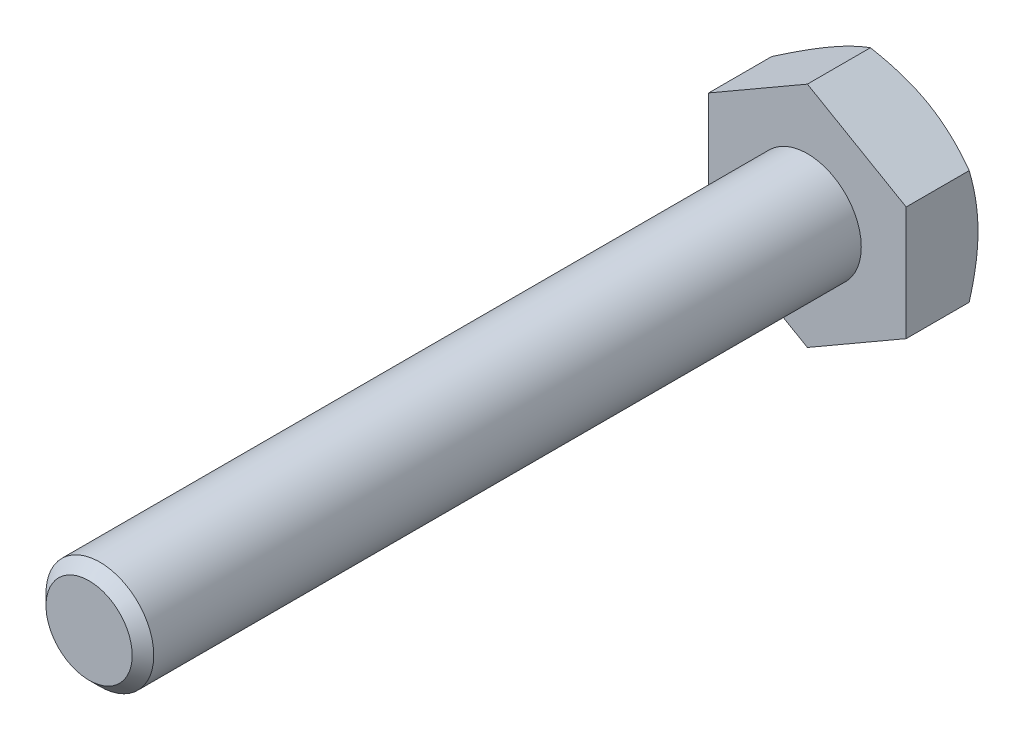
ISO-10303-21;
HEADER;
FILE_DESCRIPTION(('STEP AP214'),'2;1');
FILE_NAME('part.step','',(''),(''),'','','');
FILE_SCHEMA(('AUTOMOTIVE_DESIGN { 1 0 10303 214 1 1 1 1 }'));
ENDSEC;
DATA;
#1=APPLICATION_CONTEXT('core data for automotive mechanical design processes');
#2=APPLICATION_PROTOCOL_DEFINITION('international standard','automotive_design',2000,#1);
#3=PRODUCT_CONTEXT('',#1,'mechanical');
#4=PRODUCT('Part','Part','',(#3));
#5=PRODUCT_RELATED_PRODUCT_CATEGORY('part','',(#4));
#6=PRODUCT_DEFINITION_FORMATION('','',#4);
#7=PRODUCT_DEFINITION_CONTEXT('part definition',#1,'design');
#8=PRODUCT_DEFINITION('design','',#6,#7);
#9=PRODUCT_DEFINITION_SHAPE('','',#8);
#10=(LENGTH_UNIT() NAMED_UNIT(*) SI_UNIT(.MILLI.,.METRE.));
#11=(NAMED_UNIT(*) PLANE_ANGLE_UNIT() SI_UNIT($,.RADIAN.));
#12=(NAMED_UNIT(*) SI_UNIT($,.STERADIAN.) SOLID_ANGLE_UNIT());
#13=UNCERTAINTY_MEASURE_WITH_UNIT(LENGTH_MEASURE(1.E-05),#10,'distance_accuracy_value','');
#14=(GEOMETRIC_REPRESENTATION_CONTEXT(3) GLOBAL_UNCERTAINTY_ASSIGNED_CONTEXT((#13)) GLOBAL_UNIT_ASSIGNED_CONTEXT((#10,
#11,#12)) REPRESENTATION_CONTEXT('',''));
#15=CARTESIAN_POINT('',(0.,0.,0.));
#16=DIRECTION('',(0.,0.,1.));
#17=DIRECTION('',(1.,0.,0.));
#18=AXIS2_PLACEMENT_3D('',#15,#16,#17);
#19=CARTESIAN_POINT('',(0.,0.,20.));
#20=DIRECTION('',(0.,0.,1.));
#21=DIRECTION('',(1.,0.,0.));
#22=AXIS2_PLACEMENT_3D('',#19,#20,#21);
#23=PLANE('',#22);
#24=CARTESIAN_POINT('',(0.,0.,20.));
#25=DIRECTION('',(0.,0.,1.));
#26=DIRECTION('',(1.,0.,0.));
#27=AXIS2_PLACEMENT_3D('',#24,#25,#26);
#28=CIRCLE('',#27,1.2);
#29=CARTESIAN_POINT('',(1.2,0.,20.));
#30=VERTEX_POINT('',#29);
#31=EDGE_CURVE('E207',#30,#30,#28,.T.);
#32=ORIENTED_EDGE('',*,*,#31,.T.);
#33=EDGE_LOOP('',(#32));
#34=FACE_BOUND('',#33,.T.);
#35=ADVANCED_FACE('F33',(#34),#23,.T.);
#36=CARTESIAN_POINT('',(0.,0.,0.));
#37=DIRECTION('',(0.,0.,1.));
#38=DIRECTION('',(1.,0.,0.));
#39=AXIS2_PLACEMENT_3D('',#36,#37,#38);
#40=CYLINDRICAL_SURFACE('',#39,1.5);
#41=CARTESIAN_POINT('',(0.,0.,19.7));
#42=DIRECTION('',(0.,0.,1.));
#43=DIRECTION('',(1.,0.,0.));
#44=AXIS2_PLACEMENT_3D('',#41,#42,#43);
#45=CIRCLE('',#44,1.5);
#46=CARTESIAN_POINT('',(1.5,0.,19.7));
#47=VERTEX_POINT('',#46);
#48=EDGE_CURVE('E209',#47,#47,#45,.F.);
#49=ORIENTED_EDGE('',*,*,#48,.T.);
#50=EDGE_LOOP('',(#49));
#51=FACE_BOUND('',#50,.T.);
#52=CARTESIAN_POINT('',(0.,0.,0.));
#53=DIRECTION('',(0.,0.,1.));
#54=DIRECTION('',(1.,0.,0.));
#55=AXIS2_PLACEMENT_3D('',#52,#53,#54);
#56=CIRCLE('',#55,1.5);
#57=CARTESIAN_POINT('',(1.5,0.,0.));
#58=VERTEX_POINT('',#57);
#59=EDGE_CURVE('E210',#58,#58,#56,.F.);
#60=ORIENTED_EDGE('',*,*,#59,.F.);
#61=EDGE_LOOP('',(#60));
#62=FACE_BOUND('',#61,.T.);
#63=ADVANCED_FACE('F198',(#51,#62),#40,.T.);
#64=CARTESIAN_POINT('',(0.,0.,20.));
#65=DIRECTION('',(0.,0.,-1.));
#66=DIRECTION('',(-1.,0.,0.));
#67=AXIS2_PLACEMENT_3D('',#64,#65,#66);
#68=CONICAL_SURFACE('',#67,1.2,0.785398163397446);
#69=ORIENTED_EDGE('',*,*,#48,.F.);
#70=EDGE_LOOP('',(#69));
#71=FACE_BOUND('',#70,.T.);
#72=ORIENTED_EDGE('',*,*,#31,.F.);
#73=EDGE_LOOP('',(#72));
#74=FACE_BOUND('',#73,.T.);
#75=ADVANCED_FACE('F203',(#71,#74),#68,.T.);
#76=CARTESIAN_POINT('',(0.,3.17542648054294,-2.));
#77=DIRECTION('',(0.499999999999997,0.86602540378444,0.));
#78=DIRECTION('',(-0.866025403784439,0.499999999999998,0.));
#79=AXIS2_PLACEMENT_3D('',#76,#77,#78);
#80=PLANE('',#79);
#81=CARTESIAN_POINT('',(-0.000199999999977996,3.17554195059678,-1.75431323663524));
#82=CARTESIAN_POINT('',(0.120649220659921,3.10576962051743,-1.79461233775074));
#83=CARTESIAN_POINT('',(0.242541602622644,3.03539502097908,-1.83126309740234));
#84=CARTESIAN_POINT('',(0.488437126727894,2.89342717394439,-1.8952378170302));
#85=CARTESIAN_POINT('',(0.612444638573854,2.82183140359859,-1.9225391443255));
#86=CARTESIAN_POINT('',(0.858922797975938,2.67952717191843,-1.96503825470588));
#87=CARTESIAN_POINT('',(0.98135551858741,2.60884060771579,-1.98051888137754));
#88=CARTESIAN_POINT('',(1.2267971423689,2.46713482015519,-1.99900060263006));
#89=CARTESIAN_POINT('',(1.34980515323288,2.39611611197038,-2.0020170005374));
#90=CARTESIAN_POINT('',(1.57965878661076,2.26341005486545,-1.99574685457145));
#91=CARTESIAN_POINT('',(1.686538791254,2.2017028554137,-1.9879998457233));
#92=CARTESIAN_POINT('',(1.89960246733474,2.07869048467397,-1.96344481893564));
#93=CARTESIAN_POINT('',(2.00578540164888,2.01738573896435,-1.94662841034943));
#94=CARTESIAN_POINT('',(2.21928848939318,1.89411967378236,-1.90458807765404));
#95=CARTESIAN_POINT('',(2.32658161614285,1.83217395817124,-1.87918591931277));
#96=CARTESIAN_POINT('',(2.53956747928405,1.70920651275308,-1.82153277416001));
#97=CARTESIAN_POINT('',(2.64526294502666,1.64818320715447,-1.78929533670101));
#98=CARTESIAN_POINT('',(2.75020000000001,1.58759777021764,-1.75431323663524));
#99=B_SPLINE_CURVE_WITH_KNOTS('',3,(#81,#82,#83,#84,#85,#86,#87,#88,#89,#90,#91,#92,#93,#94,#95,
#96,#97,#98),.UNSPECIFIED.,.F.,.F.,(4,2,2,2,2,2,2,2,4),(0.,0.435912828725876,0.872873557116309,
1.29901931904668,1.72464171213569,2.09526089052934,2.46622354066371,2.84541551798555,
3.22386274754523),.UNSPECIFIED.);
#100=CARTESIAN_POINT('',(0.,3.17542648054294,-1.75437990693814));
#101=VERTEX_POINT('',#100);
#102=CARTESIAN_POINT('',(1.37500000000004,2.38156986040721,-2.));
#103=VERTEX_POINT('',#102);
#104=EDGE_CURVE('E243',#101,#103,#99,.T.);
#105=ORIENTED_EDGE('',*,*,#104,.F.);
#106=DIRECTION('',(0.,0.,1.));
#107=VECTOR('',#106,1.);
#108=CARTESIAN_POINT('',(0.,3.17542648054294,-2.));
#109=LINE('',#108,#107);
#110=CARTESIAN_POINT('',(0.,3.17542648054294,0.));
#111=VERTEX_POINT('',#110);
#112=EDGE_CURVE('E217',#101,#111,#109,.T.);
#113=ORIENTED_EDGE('',*,*,#112,.T.);
#114=DIRECTION('',(-0.866025403784439,0.499999999999998,0.));
#115=VECTOR('',#114,1.);
#116=CARTESIAN_POINT('',(0.,3.17542648054294,0.));
#117=LINE('',#116,#115);
#118=CARTESIAN_POINT('',(2.75,1.58771324027147,0.));
#119=VERTEX_POINT('',#118);
#120=EDGE_CURVE('E241',#119,#111,#117,.T.);
#121=ORIENTED_EDGE('',*,*,#120,.F.);
#122=DIRECTION('',(0.,0.,1.));
#123=VECTOR('',#122,1.);
#124=CARTESIAN_POINT('',(2.75,1.58771324027147,-2.));
#125=LINE('',#124,#123);
#126=CARTESIAN_POINT('',(2.75,1.58771324027147,-1.75437990693814));
#127=VERTEX_POINT('',#126);
#128=EDGE_CURVE('E214',#127,#119,#125,.T.);
#129=ORIENTED_EDGE('',*,*,#128,.F.);
#130=EDGE_CURVE('E173',#103,#127,#99,.T.);
#131=ORIENTED_EDGE('',*,*,#130,.F.);
#132=EDGE_LOOP('',(#105,#113,#121,#129,#131));
#133=FACE_BOUND('',#132,.T.);
#134=ADVANCED_FACE('F183',(#133),#80,.T.);
#135=CARTESIAN_POINT('',(2.75,-1.58771324027148,-2.));
#136=DIRECTION('',(1.,0.,0.));
#137=DIRECTION('',(0.,0.,-1.));
#138=AXIS2_PLACEMENT_3D('',#135,#136,#137);
#139=PLANE('',#138);
#140=CARTESIAN_POINT('',(2.75,-4.31638594918235,-0.632847892955916));
#141=CARTESIAN_POINT('',(2.75,-4.19581737051595,-0.691540059035233));
#142=CARTESIAN_POINT('',(2.75,-4.07497746694742,-0.749684135747812));
#143=CARTESIAN_POINT('',(2.75,-3.83261088383626,-0.864568802587682));
#144=CARTESIAN_POINT('',(2.75,-3.71108410410337,-0.921309181118006));
#145=CARTESIAN_POINT('',(2.75,-3.466598087899,-1.03335357340865));
#146=CARTESIAN_POINT('',(2.75,-3.34363468385966,-1.08864852386122));
#147=CARTESIAN_POINT('',(2.75,-3.09674757673778,-1.19704300604234));
#148=CARTESIAN_POINT('',(2.75,-2.97282391790202,-1.25014263822122));
#149=CARTESIAN_POINT('',(2.75,-2.71965806564945,-1.35529688241174));
#150=CARTESIAN_POINT('',(2.75,-2.59037652858397,-1.40725727563287));
#151=CARTESIAN_POINT('',(2.75,-2.3303201842919,-1.50736896164764));
#152=CARTESIAN_POINT('',(2.75000000000001,-2.19954521421089,-1.55551983439677));
#153=CARTESIAN_POINT('',(2.75,-1.93652234449221,-1.64678634380981));
#154=CARTESIAN_POINT('',(2.74999999999999,-1.80427786301002,-1.68991173484879));
#155=CARTESIAN_POINT('',(2.75000000000002,-1.53789259482415,-1.76977779036782));
#156=CARTESIAN_POINT('',(2.75000000000006,-1.40375240288283,-1.80652041132123));
#157=CARTESIAN_POINT('',(2.75000000000006,-1.13423793476322,-1.87169793220834));
#158=CARTESIAN_POINT('',(2.75000000000002,-0.998874970875653,-1.90017876305552));
#159=CARTESIAN_POINT('',(2.74999999999999,-0.726413092453883,-1.94725438383083));
#160=CARTESIAN_POINT('',(2.75,-0.589314364619272,-1.96585022789777));
#161=CARTESIAN_POINT('',(2.75,-0.315877662564301,-1.99143141347502));
#162=CARTESIAN_POINT('',(2.74999999999999,-0.179554395289448,-1.99857007320949));
#163=CARTESIAN_POINT('',(2.75000000000002,0.0932131339370683,-2.00103867463559));
#164=CARTESIAN_POINT('',(2.75000000000007,0.22965739793603,-1.99636841255316));
#165=CARTESIAN_POINT('',(2.75000000000005,0.459764674388289,-1.97886953680312));
#166=CARTESIAN_POINT('',(2.75000000000002,0.553667213671698,-1.96899498288053));
#167=CARTESIAN_POINT('',(2.74999999999999,0.740814471055641,-1.94423986046834));
#168=CARTESIAN_POINT('',(2.75,0.834059104056989,-1.92935865607073));
#169=CARTESIAN_POINT('',(2.75000000000001,1.11266283109748,-1.87798420110181));
#170=CARTESIAN_POINT('',(2.75,1.29679769159134,-1.83476823883647));
#171=CARTESIAN_POINT('',(2.75,1.57226006867404,-1.75944008766883));
#172=CARTESIAN_POINT('',(2.75,1.66500394654351,-1.73220910549317));
#173=CARTESIAN_POINT('',(2.75,1.84959145582331,-1.67482333858274));
#174=CARTESIAN_POINT('',(2.75,1.94143508041949,-1.64466853173595));
#175=CARTESIAN_POINT('',(2.75,2.12425036464144,-1.58192697817571));
#176=CARTESIAN_POINT('',(2.75,2.21522226940172,-1.54934093922709));
#177=CARTESIAN_POINT('',(2.75,2.39640501304848,-1.48212985496412));
#178=CARTESIAN_POINT('',(2.75,2.4866158682976,-1.44750485361602));
#179=CARTESIAN_POINT('',(2.75,2.72631941369532,-1.35288813187126));
#180=CARTESIAN_POINT('',(2.75,2.87521406734212,-1.29138286656289));
#181=CARTESIAN_POINT('',(2.75,3.17149877963131,-1.16483689190358));
#182=CARTESIAN_POINT('',(2.75,3.31888867900124,-1.09979581281547));
#183=CARTESIAN_POINT('',(2.75,3.61249860697598,-0.967006270157887));
#184=CARTESIAN_POINT('',(2.75,3.75871823242038,-0.899256918022104));
#185=CARTESIAN_POINT('',(2.75,4.05017738563281,-0.761678024306228));
#186=CARTESIAN_POINT('',(2.75,4.19541688424479,-0.691848421176089));
#187=CARTESIAN_POINT('',(2.75,4.63039070223178,-0.479727791936906));
#188=CARTESIAN_POINT('',(2.75,4.91893915080494,-0.335008057930881));
#189=CARTESIAN_POINT('',(2.75,5.49386340867,-0.0414857349417502));
#190=CARTESIAN_POINT('',(2.75,5.78023963786971,0.107316037875523));
#191=CARTESIAN_POINT('',(2.75,6.32194576487131,0.392167572255351));
#192=CARTESIAN_POINT('',(2.75,6.57742037004846,0.527942619149233));
#193=CARTESIAN_POINT('',(2.75,7.08750371442344,0.801142452727624));
#194=CARTESIAN_POINT('',(2.75,7.34211240206397,0.938567335511659));
#195=CARTESIAN_POINT('',(2.75,7.84983547824254,1.21419429818606));
#196=CARTESIAN_POINT('',(2.75,8.10295203313651,1.35239239225703));
#197=CARTESIAN_POINT('',(2.75,8.60864374493553,1.6297305925327));
#198=CARTESIAN_POINT('',(2.75,8.86121894150216,1.76887062638961));
#199=CARTESIAN_POINT('',(2.75,9.11360311770112,1.90835389259641));
#200=B_SPLINE_CURVE_WITH_KNOTS('',3,(#140,#141,#142,#143,#144,#145,#146,#147,#148,#149,#150,
#151,#152,#153,#154,#155,#156,#157,#158,#159,#160,#161,#162,#163,#164,#165,#166,#167,#168,#169,
#170,#171,#172,#173,#174,#175,#176,#177,#178,#179,#180,#181,#182,#183,#184,#185,#186,#187,#188,
#189,#190,#191,#192,#193,#194,#195,#196,#197,#198,#199),.UNSPECIFIED.,.F.,.F.,(4,2,2,2,2,2,2,2,
2,2,2,2,2,2,2,2,2,2,2,2,2,2,2,2,2,2,2,2,2,4),(0.,0.402290608258891,0.804641493784548,
1.20909649725656,1.6135329737118,2.03148461048146,2.44948226730266,2.86665458560837,
3.28369880400759,3.69837799217318,4.11301294991384,4.52205162226937,4.93109735302042,
5.21422195546487,5.49738253190367,6.06398562819833,6.35393648052212,6.64388952582948,
6.93375848874898,7.22362120349518,7.70684704660547,8.19012351781082,8.67355987154434,
9.15701054332951,10.1253686031769,11.0935344400116,11.9614658313278,12.8294480255313,
13.694604925882,14.5596961132789),.UNSPECIFIED.);
#201=CARTESIAN_POINT('',(2.75,0.,-2.));
#202=VERTEX_POINT('',#201);
#203=EDGE_CURVE('E171',#127,#202,#200,.F.);
#204=ORIENTED_EDGE('',*,*,#203,.F.);
#205=ORIENTED_EDGE('',*,*,#128,.T.);
#206=DIRECTION('',(0.,1.,0.));
#207=VECTOR('',#206,1.);
#208=CARTESIAN_POINT('',(2.75,-1.58771324027148,0.));
#209=LINE('',#208,#207);
#210=CARTESIAN_POINT('',(2.75,-1.58771324027148,0.));
#211=VERTEX_POINT('',#210);
#212=EDGE_CURVE('E219',#211,#119,#209,.T.);
#213=ORIENTED_EDGE('',*,*,#212,.F.);
#214=DIRECTION('',(0.,0.,1.));
#215=VECTOR('',#214,1.);
#216=CARTESIAN_POINT('',(2.75,-1.58771324027148,-2.));
#217=LINE('',#216,#215);
#218=CARTESIAN_POINT('',(2.75,-1.58771324027147,-1.75437990693814));
#219=VERTEX_POINT('',#218);
#220=EDGE_CURVE('E225',#219,#211,#217,.T.);
#221=ORIENTED_EDGE('',*,*,#220,.F.);
#222=EDGE_CURVE('E166',#202,#219,#200,.F.);
#223=ORIENTED_EDGE('',*,*,#222,.F.);
#224=EDGE_LOOP('',(#204,#205,#213,#221,#223));
#225=FACE_BOUND('',#224,.T.);
#226=ADVANCED_FACE('F179',(#225),#139,.T.);
#227=CARTESIAN_POINT('',(0.,-3.17542648054294,-2.));
#228=DIRECTION('',(0.499999999999998,-0.86602540378444,0.));
#229=DIRECTION('',(0.866025403784439,0.499999999999998,0.));
#230=AXIS2_PLACEMENT_3D('',#227,#228,#229);
#231=PLANE('',#230);
#232=CARTESIAN_POINT('',(2.75020000000001,-1.58759777021764,-1.75431323663524));
#233=CARTESIAN_POINT('',(2.62935077934011,-1.657370100297,-1.79461233775073));
#234=CARTESIAN_POINT('',(2.50745839737738,-1.72774469983535,-1.83126309740233));
#235=CARTESIAN_POINT('',(2.26156287327212,-1.86971254687005,-1.89523781703019));
#236=CARTESIAN_POINT('',(2.13755536142616,-1.94130831721585,-1.92253914432549));
#237=CARTESIAN_POINT('',(1.89107720202407,-2.08361254889601,-1.96503825470587));
#238=CARTESIAN_POINT('',(1.7686444814126,-2.15429911309866,-1.98051888137753));
#239=CARTESIAN_POINT('',(1.5232028576311,-2.29600490065924,-1.99900060263005));
#240=CARTESIAN_POINT('',(1.40019484676709,-2.36702360884404,-2.0020170005374));
#241=CARTESIAN_POINT('',(1.17034121338921,-2.49972966594897,-1.99574685457145));
#242=CARTESIAN_POINT('',(1.06346120874599,-2.56143686540074,-1.98799984572329));
#243=CARTESIAN_POINT('',(0.850397532665264,-2.68444923614048,-1.96344481893563));
#244=CARTESIAN_POINT('',(0.744214598351122,-2.74575398185009,-1.94662841034942));
#245=CARTESIAN_POINT('',(0.530711510606824,-2.86902004703208,-1.90458807765403));
#246=CARTESIAN_POINT('',(0.423418383857153,-2.9309657626432,-1.87918591931276));
#247=CARTESIAN_POINT('',(0.210432520715954,-3.05393320806135,-1.82153277416001));
#248=CARTESIAN_POINT('',(0.104737054973349,-3.11495651365996,-1.78929533670101));
#249=CARTESIAN_POINT('',(-0.000200000000005751,-3.17554195059678,-1.75431323663524));
#250=B_SPLINE_CURVE_WITH_KNOTS('',3,(#232,#233,#234,#235,#236,#237,#238,#239,#240,#241,#242,
#243,#244,#245,#246,#247,#248,#249),.UNSPECIFIED.,.F.,.F.,(4,2,2,2,2,2,2,2,4),(0.,
0.435912828725886,0.872873557116331,1.29901931904671,1.72464171213573,2.09526089052937,
2.46622354066375,2.84541551798558,3.22386274754525),.UNSPECIFIED.);
#251=CARTESIAN_POINT('',(1.37500000000004,-2.38156986040721,-2.));
#252=VERTEX_POINT('',#251);
#253=EDGE_CURVE('E172',#219,#252,#250,.T.);
#254=ORIENTED_EDGE('',*,*,#253,.F.);
#255=ORIENTED_EDGE('',*,*,#220,.T.);
#256=DIRECTION('',(0.866025403784439,0.499999999999998,0.));
#257=VECTOR('',#256,1.);
#258=CARTESIAN_POINT('',(0.,-3.17542648054294,0.));
#259=LINE('',#258,#257);
#260=CARTESIAN_POINT('',(0.,-3.17542648054294,0.));
#261=VERTEX_POINT('',#260);
#262=EDGE_CURVE('E230',#261,#211,#259,.T.);
#263=ORIENTED_EDGE('',*,*,#262,.F.);
#264=DIRECTION('',(0.,0.,1.));
#265=VECTOR('',#264,1.);
#266=CARTESIAN_POINT('',(0.,-3.17542648054294,-2.));
#267=LINE('',#266,#265);
#268=CARTESIAN_POINT('',(0.,-3.17542648054294,-1.75437990693814));
#269=VERTEX_POINT('',#268);
#270=EDGE_CURVE('E223',#269,#261,#267,.T.);
#271=ORIENTED_EDGE('',*,*,#270,.F.);
#272=EDGE_CURVE('E160',#252,#269,#250,.T.);
#273=ORIENTED_EDGE('',*,*,#272,.F.);
#274=EDGE_LOOP('',(#254,#255,#263,#271,#273));
#275=FACE_BOUND('',#274,.T.);
#276=ADVANCED_FACE('F182',(#275),#231,.T.);
#277=CARTESIAN_POINT('',(0.,-3.17542648054294,-2.));
#278=DIRECTION('',(-0.500000000000001,-0.866025403784438,0.));
#279=DIRECTION('',(0.866025403784437,-0.500000000000001,0.));
#280=AXIS2_PLACEMENT_3D('',#277,#278,#279);
#281=PLANE('',#280);
#282=CARTESIAN_POINT('',(0.000200000000005751,-3.17554195059678,-1.75431323663524));
#283=CARTESIAN_POINT('',(-0.120649220659895,-3.10576962051742,-1.79461233775074));
#284=CARTESIAN_POINT('',(-0.24254160262262,-3.03539502097908,-1.83126309740234));
#285=CARTESIAN_POINT('',(-0.488437126727875,-2.89342717394438,-1.8952378170302));
#286=CARTESIAN_POINT('',(-0.612444638573836,-2.82183140359858,-1.92253914432551));
#287=CARTESIAN_POINT('',(-0.858922797975921,-2.67952717191842,-1.96503825470589));
#288=CARTESIAN_POINT('',(-0.981355518587393,-2.60884060771577,-1.98051888137755));
#289=CARTESIAN_POINT('',(-1.22679714236889,-2.46713482015518,-1.99900060263006));
#290=CARTESIAN_POINT('',(-1.34980515323288,-2.39611611197037,-2.0020170005374));
#291=CARTESIAN_POINT('',(-1.57965878661076,-2.26341005486544,-1.99574685457145));
#292=CARTESIAN_POINT('',(-1.68653879125399,-2.20170285541369,-1.98799984572331));
#293=CARTESIAN_POINT('',(-1.89960246733472,-2.07869048467395,-1.96344481893566));
#294=CARTESIAN_POINT('',(-2.00578540164885,-2.01738573896434,-1.94662841034944));
#295=CARTESIAN_POINT('',(-2.21928848939315,-1.89411967378235,-1.90458807765406));
#296=CARTESIAN_POINT('',(-2.32658161614282,-1.83217395817123,-1.87918591931279));
#297=CARTESIAN_POINT('',(-2.53956747928401,-1.70920651275308,-1.82153277416003));
#298=CARTESIAN_POINT('',(-2.64526294502661,-1.64818320715447,-1.78929533670103));
#299=CARTESIAN_POINT('',(-2.75019999999995,-1.58759777021764,-1.75431323663524));
#300=B_SPLINE_CURVE_WITH_KNOTS('',3,(#282,#283,#284,#285,#286,#287,#288,#289,#290,#291,#292,
#293,#294,#295,#296,#297,#298,#299),.UNSPECIFIED.,.F.,.F.,(4,2,2,2,2,2,2,2,4),(0.,
0.435912828725885,0.872873557116323,1.2990193190467,1.72464171213572,2.09526089052935,
2.46622354066372,2.84541551798554,3.22386274754521),.UNSPECIFIED.);
#301=CARTESIAN_POINT('',(-1.37499999999999,-2.38156986040721,-2.));
#302=VERTEX_POINT('',#301);
#303=EDGE_CURVE('E262',#269,#302,#300,.T.);
#304=ORIENTED_EDGE('',*,*,#303,.F.);
#305=ORIENTED_EDGE('',*,*,#270,.T.);
#306=DIRECTION('',(0.866025403784437,-0.500000000000001,0.));
#307=VECTOR('',#306,1.);
#308=CARTESIAN_POINT('',(0.,-3.17542648054294,0.));
#309=LINE('',#308,#307);
#310=CARTESIAN_POINT('',(-2.74999999999995,-1.58771324027148,0.));
#311=VERTEX_POINT('',#310);
#312=EDGE_CURVE('E233',#311,#261,#309,.T.);
#313=ORIENTED_EDGE('',*,*,#312,.F.);
#314=DIRECTION('',(0.,0.,1.));
#315=VECTOR('',#314,1.);
#316=CARTESIAN_POINT('',(-2.74999999999995,-1.58771324027148,-2.));
#317=LINE('',#316,#315);
#318=CARTESIAN_POINT('',(-2.74999999999995,-1.58771324027164,-1.75437990693825));
#319=VERTEX_POINT('',#318);
#320=EDGE_CURVE('E221',#319,#311,#317,.T.);
#321=ORIENTED_EDGE('',*,*,#320,.F.);
#322=EDGE_CURVE('E109',#302,#319,#300,.T.);
#323=ORIENTED_EDGE('',*,*,#322,.F.);
#324=EDGE_LOOP('',(#304,#305,#313,#321,#323));
#325=FACE_BOUND('',#324,.T.);
#326=ADVANCED_FACE('F187',(#325),#281,.T.);
#327=CARTESIAN_POINT('',(-2.74999999999995,-1.58771324027148,-2.));
#328=DIRECTION('',(-1.,0.,0.));
#329=DIRECTION('',(0.,0.,1.));
#330=AXIS2_PLACEMENT_3D('',#327,#328,#329);
#331=PLANE('',#330);
#332=CARTESIAN_POINT('',(-2.75,-4.31638594918235,-0.632847892955913));
#333=CARTESIAN_POINT('',(-2.74999999999997,-4.19581737051595,-0.691540059035241));
#334=CARTESIAN_POINT('',(-2.74999999999995,-4.07497746694743,-0.749684135747826));
#335=CARTESIAN_POINT('',(-2.74999999999994,-3.83261088383626,-0.8645688025877));
#336=CARTESIAN_POINT('',(-2.74999999999995,-3.71108410410338,-0.921309181118022));
#337=CARTESIAN_POINT('',(-2.74999999999995,-3.466598087899,-1.03335357340867));
#338=CARTESIAN_POINT('',(-2.74999999999995,-3.34363468385967,-1.08864852386123));
#339=CARTESIAN_POINT('',(-2.74999999999995,-3.09674757673779,-1.19704300604236));
#340=CARTESIAN_POINT('',(-2.74999999999995,-2.97282391790203,-1.25014263822123));
#341=CARTESIAN_POINT('',(-2.74999999999995,-2.71965806564946,-1.35529688241176));
#342=CARTESIAN_POINT('',(-2.74999999999995,-2.59037652858398,-1.40725727563289));
#343=CARTESIAN_POINT('',(-2.74999999999995,-2.33032018429191,-1.50736896164766));
#344=CARTESIAN_POINT('',(-2.74999999999995,-2.1995452142109,-1.55551983439679));
#345=CARTESIAN_POINT('',(-2.74999999999994,-1.93652234449223,-1.64678634380983));
#346=CARTESIAN_POINT('',(-2.74999999999993,-1.80427786301004,-1.68991173484882));
#347=CARTESIAN_POINT('',(-2.74999999999996,-1.53789259482416,-1.76977779036783));
#348=CARTESIAN_POINT('',(-2.75,-1.40375240288283,-1.80652041132122));
#349=CARTESIAN_POINT('',(-2.75,-1.13423793476322,-1.87169793220834));
#350=CARTESIAN_POINT('',(-2.74999999999996,-0.998874970875656,-1.90017876305554));
#351=CARTESIAN_POINT('',(-2.74999999999993,-0.726413092453889,-1.94725438383087));
#352=CARTESIAN_POINT('',(-2.74999999999995,-0.589314364619277,-1.9658502278978));
#353=CARTESIAN_POINT('',(-2.74999999999995,-0.315877662564304,-1.99143141347505));
#354=CARTESIAN_POINT('',(-2.74999999999993,-0.179554395289451,-1.99857007320953));
#355=CARTESIAN_POINT('',(-2.74999999999996,0.0932131339370656,-2.00103867463561));
#356=CARTESIAN_POINT('',(-2.75000000000001,0.229657397936027,-1.99636841255316));
#357=CARTESIAN_POINT('',(-2.75,0.45976467438829,-1.97886953680312));
#358=CARTESIAN_POINT('',(-2.74999999999996,0.553667213671703,-1.96899498288056));
#359=CARTESIAN_POINT('',(-2.74999999999993,0.740814471055649,-1.94423986046838));
#360=CARTESIAN_POINT('',(-2.74999999999994,0.834059104056997,-1.92935865607076));
#361=CARTESIAN_POINT('',(-2.74999999999996,1.11266283109749,-1.87798420110184));
#362=CARTESIAN_POINT('',(-2.74999999999995,1.29679769159135,-1.8347682388365));
#363=CARTESIAN_POINT('',(-2.74999999999995,1.57226006867405,-1.75944008766886));
#364=CARTESIAN_POINT('',(-2.74999999999995,1.66500394654352,-1.73220910549319));
#365=CARTESIAN_POINT('',(-2.74999999999995,1.84959145582331,-1.67482333858276));
#366=CARTESIAN_POINT('',(-2.74999999999995,1.9414350804195,-1.64466853173597));
#367=CARTESIAN_POINT('',(-2.74999999999994,2.12425036464145,-1.58192697817573));
#368=CARTESIAN_POINT('',(-2.74999999999993,2.21522226940173,-1.54934093922712));
#369=CARTESIAN_POINT('',(-2.74999999999996,2.39640501304849,-1.48212985496413));
#370=CARTESIAN_POINT('',(-2.74999999999999,2.4866158682976,-1.44750485361603));
#371=CARTESIAN_POINT('',(-2.75000000000002,2.72631941369532,-1.35288813187125));
#372=CARTESIAN_POINT('',(-2.74999999999997,2.87521406734213,-1.2913828665629));
#373=CARTESIAN_POINT('',(-2.74999999999993,3.17149877963133,-1.1648368919036));
#374=CARTESIAN_POINT('',(-2.74999999999994,3.31888867900126,-1.09979581281548));
#375=CARTESIAN_POINT('',(-2.74999999999995,3.61249860697599,-0.967006270157898));
#376=CARTESIAN_POINT('',(-2.74999999999995,3.7587182324204,-0.899256918022114));
#377=CARTESIAN_POINT('',(-2.74999999999995,4.05017738563283,-0.761678024306239));
#378=CARTESIAN_POINT('',(-2.74999999999995,4.19541688424481,-0.691848421176099));
#379=CARTESIAN_POINT('',(-2.74999999999995,4.63039070223179,-0.479727791936915));
#380=CARTESIAN_POINT('',(-2.74999999999995,4.91893915080495,-0.33500805793089));
#381=CARTESIAN_POINT('',(-2.74999999999995,5.49386340867001,-0.0414857349417578));
#382=CARTESIAN_POINT('',(-2.74999999999995,5.78023963786972,0.107316037875516));
#383=CARTESIAN_POINT('',(-2.74999999999995,6.32194576487132,0.392167572255344));
#384=CARTESIAN_POINT('',(-2.74999999999995,6.57742037004847,0.527942619149225));
#385=CARTESIAN_POINT('',(-2.74999999999995,7.08750371442344,0.801142452727616));
#386=CARTESIAN_POINT('',(-2.74999999999995,7.34211240206397,0.938567335511652));
#387=CARTESIAN_POINT('',(-2.74999999999995,7.84983547824254,1.21419429818605));
#388=CARTESIAN_POINT('',(-2.74999999999994,8.10295203313652,1.35239239225702));
#389=CARTESIAN_POINT('',(-2.74999999999995,8.60864374493554,1.62973059253269));
#390=CARTESIAN_POINT('',(-2.74999999999997,8.86121894150217,1.76887062638961));
#391=CARTESIAN_POINT('',(-2.75,9.11360311770112,1.90835389259642));
#392=B_SPLINE_CURVE_WITH_KNOTS('',3,(#332,#333,#334,#335,#336,#337,#338,#339,#340,#341,#342,
#343,#344,#345,#346,#347,#348,#349,#350,#351,#352,#353,#354,#355,#356,#357,#358,#359,#360,#361,
#362,#363,#364,#365,#366,#367,#368,#369,#370,#371,#372,#373,#374,#375,#376,#377,#378,#379,#380,
#381,#382,#383,#384,#385,#386,#387,#388,#389,#390,#391),.UNSPECIFIED.,.F.,.F.,(4,2,2,2,2,2,2,2,
2,2,2,2,2,2,2,2,2,2,2,2,2,2,2,2,2,2,2,2,2,4),(0.,0.402290608258894,0.804641493784553,
1.20909649725656,1.6135329737118,2.03148461048146,2.44948226730266,2.86665458560836,
3.2836988040076,3.69837799217319,4.11301294991385,4.52205162226937,4.93109735302043,
5.21422195546489,5.49738253190368,6.06398562819835,6.35393648052213,6.6438895258295,
6.933758488749,7.2236212034952,7.70684704660549,8.19012351781084,8.67355987154437,
9.15701054332954,10.1253686031769,11.0935344400116,11.9614658313278,12.8294480255313,
13.694604925882,14.559696113279),.UNSPECIFIED.);
#393=CARTESIAN_POINT('',(-2.74999999999995,0.,-2.));
#394=VERTEX_POINT('',#393);
#395=EDGE_CURVE('E104',#319,#394,#392,.T.);
#396=ORIENTED_EDGE('',*,*,#395,.F.);
#397=ORIENTED_EDGE('',*,*,#320,.T.);
#398=DIRECTION('',(0.,-1.,0.));
#399=VECTOR('',#398,1.);
#400=CARTESIAN_POINT('',(-2.74999999999995,-1.58771324027148,0.));
#401=LINE('',#400,#399);
#402=CARTESIAN_POINT('',(-2.74999999999995,1.58771324027148,0.));
#403=VERTEX_POINT('',#402);
#404=EDGE_CURVE('E236',#403,#311,#401,.T.);
#405=ORIENTED_EDGE('',*,*,#404,.F.);
#406=DIRECTION('',(0.,0.,1.));
#407=VECTOR('',#406,1.);
#408=CARTESIAN_POINT('',(-2.74999999999995,1.58771324027148,-2.));
#409=LINE('',#408,#407);
#410=CARTESIAN_POINT('',(-2.74999999999995,1.58771324027148,-1.75437990693814));
#411=VERTEX_POINT('',#410);
#412=EDGE_CURVE('E130',#411,#403,#409,.T.);
#413=ORIENTED_EDGE('',*,*,#412,.F.);
#414=EDGE_CURVE('E113',#394,#411,#392,.T.);
#415=ORIENTED_EDGE('',*,*,#414,.F.);
#416=EDGE_LOOP('',(#396,#397,#405,#413,#415));
#417=FACE_BOUND('',#416,.T.);
#418=ADVANCED_FACE('F128',(#417),#331,.T.);
#419=CARTESIAN_POINT('',(-2.74999999999995,1.58771324027148,-2.));
#420=DIRECTION('',(-0.500000000000001,0.866025403784438,0.));
#421=DIRECTION('',(-0.866025403784437,-0.500000000000001,0.));
#422=AXIS2_PLACEMENT_3D('',#419,#420,#421);
#423=PLANE('',#422);
#424=CARTESIAN_POINT('',(-2.75020000000001,1.58759777021764,-1.75431323663524));
#425=CARTESIAN_POINT('',(-2.62935077934009,1.65737010029697,-1.79461233775075));
#426=CARTESIAN_POINT('',(-2.50745839737735,1.72774469983532,-1.83126309740235));
#427=CARTESIAN_POINT('',(-2.26156287327209,1.86971254687001,-1.89523781703021));
#428=CARTESIAN_POINT('',(-2.13755536142612,1.94130831721582,-1.92253914432552));
#429=CARTESIAN_POINT('',(-1.89107720202403,2.08361254889598,-1.9650382547059));
#430=CARTESIAN_POINT('',(-1.76864448141255,2.15429911309864,-1.98051888137756));
#431=CARTESIAN_POINT('',(-1.52320285763104,2.29600490065923,-1.99900060263007));
#432=CARTESIAN_POINT('',(-1.40019484676704,2.36702360884404,-2.0020170005374));
#433=CARTESIAN_POINT('',(-1.17034121338916,2.49972966594898,-1.99574685457145));
#434=CARTESIAN_POINT('',(-1.06346120874593,2.56143686540073,-1.9879998457233));
#435=CARTESIAN_POINT('',(-0.850397532665203,2.68444923614047,-1.96344481893566));
#436=CARTESIAN_POINT('',(-0.744214598351065,2.74575398185008,-1.94662841034944));
#437=CARTESIAN_POINT('',(-0.530711510606773,2.86902004703207,-1.90458807765405));
#438=CARTESIAN_POINT('',(-0.423418383857104,2.93096576264318,-1.87918591931277));
#439=CARTESIAN_POINT('',(-0.210432520715911,3.05393320806134,-1.82153277416002));
#440=CARTESIAN_POINT('',(-0.104737054973311,3.11495651365995,-1.78929533670102));
#441=CARTESIAN_POINT('',(0.000200000000033507,3.17554195059678,-1.75431323663524));
#442=B_SPLINE_CURVE_WITH_KNOTS('',3,(#424,#425,#426,#427,#428,#429,#430,#431,#432,#433,#434,
#435,#436,#437,#438,#439,#440,#441),.UNSPECIFIED.,.F.,.F.,(4,2,2,2,2,2,2,2,4),(0.,
0.435912828725903,0.872873557116359,1.29901931904676,1.72464171213579,2.09526089052943,
2.46622354066379,2.84541551798561,3.22386274754528),.UNSPECIFIED.);
#443=CARTESIAN_POINT('',(-1.37499999999999,2.38156986040721,-2.));
#444=VERTEX_POINT('',#443);
#445=EDGE_CURVE('E119',#411,#444,#442,.T.);
#446=ORIENTED_EDGE('',*,*,#445,.F.);
#447=ORIENTED_EDGE('',*,*,#412,.T.);
#448=DIRECTION('',(-0.866025403784437,-0.500000000000001,0.));
#449=VECTOR('',#448,1.);
#450=CARTESIAN_POINT('',(-2.74999999999995,1.58771324027148,0.));
#451=LINE('',#450,#449);
#452=EDGE_CURVE('E239',#111,#403,#451,.T.);
#453=ORIENTED_EDGE('',*,*,#452,.F.);
#454=ORIENTED_EDGE('',*,*,#112,.F.);
#455=EDGE_CURVE('E121',#444,#101,#442,.T.);
#456=ORIENTED_EDGE('',*,*,#455,.F.);
#457=EDGE_LOOP('',(#446,#447,#453,#454,#456));
#458=FACE_BOUND('',#457,.T.);
#459=ADVANCED_FACE('F195',(#458),#423,.T.);
#460=CARTESIAN_POINT('',(2.75,1.58771324027147,0.));
#461=DIRECTION('',(0.,0.,1.));
#462=DIRECTION('',(1.,0.,0.));
#463=AXIS2_PLACEMENT_3D('',#460,#461,#462);
#464=PLANE('',#463);
#465=ORIENTED_EDGE('',*,*,#59,.T.);
#466=EDGE_LOOP('',(#465));
#467=FACE_BOUND('',#466,.T.);
#468=ORIENTED_EDGE('',*,*,#120,.T.);
#469=ORIENTED_EDGE('',*,*,#452,.T.);
#470=ORIENTED_EDGE('',*,*,#404,.T.);
#471=ORIENTED_EDGE('',*,*,#312,.T.);
#472=ORIENTED_EDGE('',*,*,#262,.T.);
#473=ORIENTED_EDGE('',*,*,#212,.T.);
#474=EDGE_LOOP('',(#468,#469,#470,#471,#472,#473));
#475=FACE_BOUND('',#474,.T.);
#476=ADVANCED_FACE('F152',(#467,#475),#464,.T.);
#477=CARTESIAN_POINT('',(0.,0.,0.));
#478=DIRECTION('',(0.,0.,1.));
#479=DIRECTION('',(1.,0.,0.));
#480=AXIS2_PLACEMENT_3D('',#477,#478,#479);
#481=CONICAL_SURFACE('',#480,6.21410161513774,1.0471975511966);
#482=ORIENTED_EDGE('',*,*,#130,.T.);
#483=ORIENTED_EDGE('',*,*,#203,.T.);
#484=CARTESIAN_POINT('',(0.,0.,-2.));
#485=DIRECTION('',(0.,0.,1.));
#486=DIRECTION('',(1.,0.,0.));
#487=AXIS2_PLACEMENT_3D('',#484,#485,#486);
#488=CIRCLE('',#487,2.75);
#489=EDGE_CURVE('E36',#103,#202,#488,.F.);
#490=ORIENTED_EDGE('',*,*,#489,.F.);
#491=EDGE_LOOP('',(#482,#483,#490));
#492=FACE_BOUND('',#491,.T.);
#493=ADVANCED_FACE('F252',(#492),#481,.T.);
#494=ORIENTED_EDGE('',*,*,#104,.T.);
#495=EDGE_CURVE('E126',#444,#103,#488,.F.);
#496=ORIENTED_EDGE('',*,*,#495,.F.);
#497=ORIENTED_EDGE('',*,*,#455,.T.);
#498=EDGE_LOOP('',(#494,#496,#497));
#499=FACE_BOUND('',#498,.T.);
#500=ADVANCED_FACE('F151',(#499),#481,.T.);
#501=ORIENTED_EDGE('',*,*,#414,.T.);
#502=ORIENTED_EDGE('',*,*,#445,.T.);
#503=CARTESIAN_POINT('',(0.,0.,-2.));
#504=DIRECTION('',(0.,0.,-1.));
#505=DIRECTION('',(-1.,0.,0.));
#506=AXIS2_PLACEMENT_3D('',#503,#504,#505);
#507=CIRCLE('',#506,2.75);
#508=EDGE_CURVE('E54',#394,#444,#507,.T.);
#509=ORIENTED_EDGE('',*,*,#508,.F.);
#510=EDGE_LOOP('',(#501,#502,#509));
#511=FACE_BOUND('',#510,.T.);
#512=ADVANCED_FACE('F117',(#511),#481,.T.);
#513=ORIENTED_EDGE('',*,*,#322,.T.);
#514=ORIENTED_EDGE('',*,*,#395,.T.);
#515=EDGE_CURVE('E106',#302,#394,#488,.F.);
#516=ORIENTED_EDGE('',*,*,#515,.F.);
#517=EDGE_LOOP('',(#513,#514,#516));
#518=FACE_BOUND('',#517,.T.);
#519=ADVANCED_FACE('F105',(#518),#481,.T.);
#520=ORIENTED_EDGE('',*,*,#272,.T.);
#521=ORIENTED_EDGE('',*,*,#303,.T.);
#522=EDGE_CURVE('E41',#252,#302,#488,.F.);
#523=ORIENTED_EDGE('',*,*,#522,.F.);
#524=EDGE_LOOP('',(#520,#521,#523));
#525=FACE_BOUND('',#524,.T.);
#526=ADVANCED_FACE('F264',(#525),#481,.T.);
#527=ORIENTED_EDGE('',*,*,#222,.T.);
#528=ORIENTED_EDGE('',*,*,#253,.T.);
#529=EDGE_CURVE('E11',#202,#252,#488,.F.);
#530=ORIENTED_EDGE('',*,*,#529,.F.);
#531=EDGE_LOOP('',(#527,#528,#530));
#532=FACE_BOUND('',#531,.T.);
#533=ADVANCED_FACE('F259',(#532),#481,.T.);
#534=CARTESIAN_POINT('',(2.75,1.58771324027147,-2.));
#535=DIRECTION('',(0.,0.,1.));
#536=DIRECTION('',(1.,0.,0.));
#537=AXIS2_PLACEMENT_3D('',#534,#535,#536);
#538=PLANE('',#537);
#539=ORIENTED_EDGE('',*,*,#489,.T.);
#540=ORIENTED_EDGE('',*,*,#529,.T.);
#541=ORIENTED_EDGE('',*,*,#522,.T.);
#542=ORIENTED_EDGE('',*,*,#515,.T.);
#543=ORIENTED_EDGE('',*,*,#508,.T.);
#544=ORIENTED_EDGE('',*,*,#495,.T.);
#545=EDGE_LOOP('',(#539,#540,#541,#542,#543,#544));
#546=FACE_BOUND('',#545,.T.);
#547=ADVANCED_FACE('F124',(#546),#538,.F.);
#548=CLOSED_SHELL('',(#35,#63,#75,#134,#226,#276,#326,#418,#459,#476,#493,#500,#512,#519,#526,
#533,#547));
#549=MANIFOLD_SOLID_BREP('B2',#548);
#550=ADVANCED_BREP_SHAPE_REPRESENTATION('',(#18,#549),#14);
#551=SHAPE_DEFINITION_REPRESENTATION(#9,#550);
ENDSEC;
END-ISO-10303-21;
